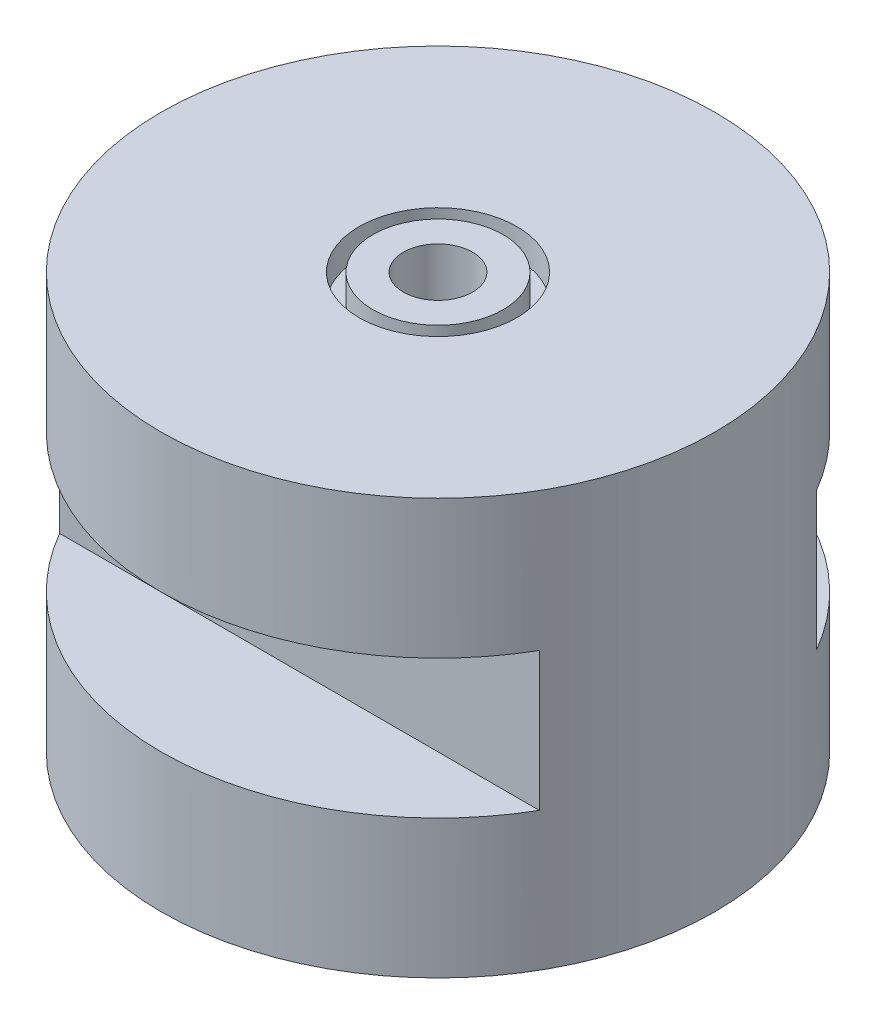
ISO-10303-21;
HEADER;
FILE_DESCRIPTION(('STEP AP214'),'2;1');
FILE_NAME('part.step','',(''),(''),'','','');
FILE_SCHEMA(('AUTOMOTIVE_DESIGN { 1 0 10303 214 1 1 1 1 }'));
ENDSEC;
DATA;
#1=APPLICATION_CONTEXT('core data for automotive mechanical design processes');
#2=APPLICATION_PROTOCOL_DEFINITION('international standard','automotive_design',2000,#1);
#3=PRODUCT_CONTEXT('',#1,'mechanical');
#4=PRODUCT('Part','Part','',(#3));
#5=PRODUCT_RELATED_PRODUCT_CATEGORY('part','',(#4));
#6=PRODUCT_DEFINITION_FORMATION('','',#4);
#7=PRODUCT_DEFINITION_CONTEXT('part definition',#1,'design');
#8=PRODUCT_DEFINITION('design','',#6,#7);
#9=PRODUCT_DEFINITION_SHAPE('','',#8);
#10=(LENGTH_UNIT() NAMED_UNIT(*) SI_UNIT(.MILLI.,.METRE.));
#11=(NAMED_UNIT(*) PLANE_ANGLE_UNIT() SI_UNIT($,.RADIAN.));
#12=(NAMED_UNIT(*) SI_UNIT($,.STERADIAN.) SOLID_ANGLE_UNIT());
#13=UNCERTAINTY_MEASURE_WITH_UNIT(LENGTH_MEASURE(1.E-05),#10,'distance_accuracy_value','');
#14=(GEOMETRIC_REPRESENTATION_CONTEXT(3) GLOBAL_UNCERTAINTY_ASSIGNED_CONTEXT((#13)) GLOBAL_UNIT_ASSIGNED_CONTEXT((#10,
#11,#12)) REPRESENTATION_CONTEXT('',''));
#15=CARTESIAN_POINT('',(0.,0.,0.));
#16=DIRECTION('',(0.,0.,1.));
#17=DIRECTION('',(1.,0.,0.));
#18=AXIS2_PLACEMENT_3D('',#15,#16,#17);
#19=CARTESIAN_POINT('',(0.,15.,0.));
#20=DIRECTION('',(0.,-1.,0.));
#21=DIRECTION('',(0.,0.,-1.));
#22=AXIS2_PLACEMENT_3D('',#19,#20,#21);
#23=CYLINDRICAL_SURFACE('',#22,10.);
#24=DIRECTION('',(0.,-1.,0.));
#25=VECTOR('',#24,1.);
#26=CARTESIAN_POINT('',(8.66025403784439,15.,-5.));
#27=LINE('',#26,#25);
#28=CARTESIAN_POINT('',(8.66025403784439,5.,-5.));
#29=VERTEX_POINT('',#28);
#30=CARTESIAN_POINT('',(8.66025403784439,10.,-5.));
#31=VERTEX_POINT('',#30);
#32=EDGE_CURVE('E82',#29,#31,#27,.F.);
#33=ORIENTED_EDGE('',*,*,#32,.T.);
#34=CARTESIAN_POINT('',(0.,10.,0.));
#35=DIRECTION('',(0.,1.,0.));
#36=DIRECTION('',(0.,0.,1.));
#37=AXIS2_PLACEMENT_3D('',#34,#35,#36);
#38=CIRCLE('',#37,10.);
#39=CARTESIAN_POINT('',(-8.66025403784439,10.,-5.));
#40=VERTEX_POINT('',#39);
#41=EDGE_CURVE('E11',#31,#40,#38,.T.);
#42=ORIENTED_EDGE('',*,*,#41,.T.);
#43=DIRECTION('',(0.,-1.,0.));
#44=VECTOR('',#43,1.);
#45=CARTESIAN_POINT('',(-8.66025403784439,15.,-5.));
#46=LINE('',#45,#44);
#47=CARTESIAN_POINT('',(-8.66025403784439,5.,-5.));
#48=VERTEX_POINT('',#47);
#49=EDGE_CURVE('E41',#40,#48,#46,.T.);
#50=ORIENTED_EDGE('',*,*,#49,.T.);
#51=CARTESIAN_POINT('',(0.,5.,0.));
#52=DIRECTION('',(0.,-1.,0.));
#53=DIRECTION('',(0.,0.,-1.));
#54=AXIS2_PLACEMENT_3D('',#51,#52,#53);
#55=CIRCLE('',#54,10.);
#56=EDGE_CURVE('E74',#48,#29,#55,.T.);
#57=ORIENTED_EDGE('',*,*,#56,.T.);
#58=EDGE_LOOP('',(#33,#42,#50,#57));
#59=FACE_BOUND('',#58,.T.);
#60=CARTESIAN_POINT('',(0.,10.,0.));
#61=DIRECTION('',(0.,1.,0.));
#62=DIRECTION('',(0.,0.,1.));
#63=AXIS2_PLACEMENT_3D('',#60,#61,#62);
#64=CIRCLE('',#63,10.);
#65=CARTESIAN_POINT('',(-8.66025403784439,10.,5.));
#66=VERTEX_POINT('',#65);
#67=CARTESIAN_POINT('',(8.66025403784439,10.,5.));
#68=VERTEX_POINT('',#67);
#69=EDGE_CURVE('E55',#66,#68,#64,.T.);
#70=ORIENTED_EDGE('',*,*,#69,.T.);
#71=DIRECTION('',(0.,-1.,0.));
#72=VECTOR('',#71,1.);
#73=CARTESIAN_POINT('',(8.66025403784439,15.,5.));
#74=LINE('',#73,#72);
#75=CARTESIAN_POINT('',(8.66025403784439,5.,5.));
#76=VERTEX_POINT('',#75);
#77=EDGE_CURVE('E93',#68,#76,#74,.T.);
#78=ORIENTED_EDGE('',*,*,#77,.T.);
#79=CARTESIAN_POINT('',(0.,5.,0.));
#80=DIRECTION('',(0.,-1.,0.));
#81=DIRECTION('',(0.,0.,-1.));
#82=AXIS2_PLACEMENT_3D('',#79,#80,#81);
#83=CIRCLE('',#82,10.);
#84=CARTESIAN_POINT('',(-8.66025403784439,5.,5.));
#85=VERTEX_POINT('',#84);
#86=EDGE_CURVE('E97',#76,#85,#83,.T.);
#87=ORIENTED_EDGE('',*,*,#86,.T.);
#88=DIRECTION('',(0.,-1.,0.));
#89=VECTOR('',#88,1.);
#90=CARTESIAN_POINT('',(-8.66025403784439,15.,5.));
#91=LINE('',#90,#89);
#92=EDGE_CURVE('E95',#85,#66,#91,.F.);
#93=ORIENTED_EDGE('',*,*,#92,.T.);
#94=EDGE_LOOP('',(#70,#78,#87,#93));
#95=FACE_BOUND('',#94,.T.);
#96=CARTESIAN_POINT('',(0.,15.,0.));
#97=DIRECTION('',(0.,1.,0.));
#98=DIRECTION('',(0.,0.,1.));
#99=AXIS2_PLACEMENT_3D('',#96,#97,#98);
#100=CIRCLE('',#99,10.);
#101=CARTESIAN_POINT('',(0.,15.,10.));
#102=VERTEX_POINT('',#101);
#103=EDGE_CURVE('E100',#102,#102,#100,.T.);
#104=ORIENTED_EDGE('',*,*,#103,.F.);
#105=EDGE_LOOP('',(#104));
#106=FACE_BOUND('',#105,.T.);
#107=CARTESIAN_POINT('',(0.,0.,0.));
#108=DIRECTION('',(0.,1.,0.));
#109=DIRECTION('',(0.,0.,1.));
#110=AXIS2_PLACEMENT_3D('',#107,#108,#109);
#111=CIRCLE('',#110,10.);
#112=CARTESIAN_POINT('',(0.,0.,10.));
#113=VERTEX_POINT('',#112);
#114=EDGE_CURVE('E101',#113,#113,#111,.T.);
#115=ORIENTED_EDGE('',*,*,#114,.T.);
#116=EDGE_LOOP('',(#115));
#117=FACE_BOUND('',#116,.T.);
#118=ADVANCED_FACE('F34',(#59,#95,#106,#117),#23,.T.);
#119=CARTESIAN_POINT('',(0.,15.,0.));
#120=DIRECTION('',(0.,1.,0.));
#121=DIRECTION('',(0.,0.,1.));
#122=AXIS2_PLACEMENT_3D('',#119,#120,#121);
#123=PLANE('',#122);
#124=CARTESIAN_POINT('',(0.,15.,0.));
#125=DIRECTION('',(0.,1.,0.));
#126=DIRECTION('',(0.,0.,1.));
#127=AXIS2_PLACEMENT_3D('',#124,#125,#126);
#128=CIRCLE('',#127,2.85);
#129=CARTESIAN_POINT('',(0.,15.,2.85));
#130=VERTEX_POINT('',#129);
#131=EDGE_CURVE('E107',#130,#130,#128,.T.);
#132=ORIENTED_EDGE('',*,*,#131,.F.);
#133=EDGE_LOOP('',(#132));
#134=FACE_BOUND('',#133,.T.);
#135=ORIENTED_EDGE('',*,*,#103,.T.);
#136=EDGE_LOOP('',(#135));
#137=FACE_BOUND('',#136,.T.);
#138=ADVANCED_FACE('F140',(#134,#137),#123,.T.);
#139=CARTESIAN_POINT('',(0.,0.,0.));
#140=DIRECTION('',(0.,1.,0.));
#141=DIRECTION('',(0.,0.,1.));
#142=AXIS2_PLACEMENT_3D('',#139,#140,#141);
#143=PLANE('',#142);
#144=CARTESIAN_POINT('',(0.,0.,0.));
#145=DIRECTION('',(0.,1.,0.));
#146=DIRECTION('',(0.,0.,1.));
#147=AXIS2_PLACEMENT_3D('',#144,#145,#146);
#148=CIRCLE('',#147,1.25);
#149=CARTESIAN_POINT('',(0.,0.,1.25));
#150=VERTEX_POINT('',#149);
#151=EDGE_CURVE('E116',#150,#150,#148,.T.);
#152=ORIENTED_EDGE('',*,*,#151,.T.);
#153=EDGE_LOOP('',(#152));
#154=FACE_BOUND('',#153,.T.);
#155=ORIENTED_EDGE('',*,*,#114,.F.);
#156=EDGE_LOOP('',(#155));
#157=FACE_BOUND('',#156,.T.);
#158=ADVANCED_FACE('F144',(#154,#157),#143,.F.);
#159=CARTESIAN_POINT('',(0.,14.,0.));
#160=DIRECTION('',(0.,1.,0.));
#161=DIRECTION('',(0.,0.,1.));
#162=AXIS2_PLACEMENT_3D('',#159,#160,#161);
#163=CYLINDRICAL_SURFACE('',#162,2.85);
#164=CARTESIAN_POINT('',(0.,14.,0.));
#165=DIRECTION('',(0.,1.,0.));
#166=DIRECTION('',(0.,0.,1.));
#167=AXIS2_PLACEMENT_3D('',#164,#165,#166);
#168=CIRCLE('',#167,2.85);
#169=CARTESIAN_POINT('',(0.,14.,2.85));
#170=VERTEX_POINT('',#169);
#171=EDGE_CURVE('E104',#170,#170,#168,.T.);
#172=ORIENTED_EDGE('',*,*,#171,.F.);
#173=EDGE_LOOP('',(#172));
#174=FACE_BOUND('',#173,.T.);
#175=ORIENTED_EDGE('',*,*,#131,.T.);
#176=EDGE_LOOP('',(#175));
#177=FACE_BOUND('',#176,.T.);
#178=ADVANCED_FACE('F151',(#174,#177),#163,.F.);
#179=CARTESIAN_POINT('',(0.,14.,0.));
#180=DIRECTION('',(0.,1.,0.));
#181=DIRECTION('',(0.,0.,1.));
#182=AXIS2_PLACEMENT_3D('',#179,#180,#181);
#183=PLANE('',#182);
#184=CARTESIAN_POINT('',(0.,14.,0.));
#185=DIRECTION('',(0.,1.,0.));
#186=DIRECTION('',(0.,0.,1.));
#187=AXIS2_PLACEMENT_3D('',#184,#185,#186);
#188=CIRCLE('',#187,2.35);
#189=CARTESIAN_POINT('',(0.,14.,2.35));
#190=VERTEX_POINT('',#189);
#191=EDGE_CURVE('E110',#190,#190,#188,.T.);
#192=ORIENTED_EDGE('',*,*,#191,.F.);
#193=EDGE_LOOP('',(#192));
#194=FACE_BOUND('',#193,.T.);
#195=ORIENTED_EDGE('',*,*,#171,.T.);
#196=EDGE_LOOP('',(#195));
#197=FACE_BOUND('',#196,.T.);
#198=ADVANCED_FACE('F167',(#194,#197),#183,.T.);
#199=CARTESIAN_POINT('',(0.,14.,0.));
#200=DIRECTION('',(0.,1.,0.));
#201=DIRECTION('',(0.,0.,1.));
#202=AXIS2_PLACEMENT_3D('',#199,#200,#201);
#203=CYLINDRICAL_SURFACE('',#202,2.35);
#204=ORIENTED_EDGE('',*,*,#191,.T.);
#205=EDGE_LOOP('',(#204));
#206=FACE_BOUND('',#205,.T.);
#207=CARTESIAN_POINT('',(0.,15.,0.));
#208=DIRECTION('',(0.,1.,0.));
#209=DIRECTION('',(0.,0.,1.));
#210=AXIS2_PLACEMENT_3D('',#207,#208,#209);
#211=CIRCLE('',#210,2.35);
#212=CARTESIAN_POINT('',(0.,15.,2.35));
#213=VERTEX_POINT('',#212);
#214=EDGE_CURVE('E113',#213,#213,#211,.T.);
#215=ORIENTED_EDGE('',*,*,#214,.F.);
#216=EDGE_LOOP('',(#215));
#217=FACE_BOUND('',#216,.T.);
#218=ADVANCED_FACE('F158',(#206,#217),#203,.T.);
#219=CARTESIAN_POINT('',(0.,15.,0.));
#220=DIRECTION('',(0.,1.,0.));
#221=DIRECTION('',(0.,0.,1.));
#222=AXIS2_PLACEMENT_3D('',#219,#220,#221);
#223=CIRCLE('',#222,1.25);
#224=CARTESIAN_POINT('',(0.,15.,1.25));
#225=VERTEX_POINT('',#224);
#226=EDGE_CURVE('E119',#225,#225,#223,.T.);
#227=ORIENTED_EDGE('',*,*,#226,.F.);
#228=EDGE_LOOP('',(#227));
#229=FACE_BOUND('',#228,.T.);
#230=ORIENTED_EDGE('',*,*,#214,.T.);
#231=EDGE_LOOP('',(#230));
#232=FACE_BOUND('',#231,.T.);
#233=ADVANCED_FACE('F147',(#229,#232),#123,.T.);
#234=CARTESIAN_POINT('',(0.,0.,0.));
#235=DIRECTION('',(0.,1.,0.));
#236=DIRECTION('',(0.,0.,1.));
#237=AXIS2_PLACEMENT_3D('',#234,#235,#236);
#238=CYLINDRICAL_SURFACE('',#237,1.25);
#239=ORIENTED_EDGE('',*,*,#151,.F.);
#240=EDGE_LOOP('',(#239));
#241=FACE_BOUND('',#240,.T.);
#242=ORIENTED_EDGE('',*,*,#226,.T.);
#243=EDGE_LOOP('',(#242));
#244=FACE_BOUND('',#243,.T.);
#245=ADVANCED_FACE('F157',(#241,#244),#238,.F.);
#246=CARTESIAN_POINT('',(-10.,10.,10.));
#247=DIRECTION('',(0.,1.,0.));
#248=DIRECTION('',(0.,0.,1.));
#249=AXIS2_PLACEMENT_3D('',#246,#247,#248);
#250=PLANE('',#249);
#251=ORIENTED_EDGE('',*,*,#69,.F.);
#252=DIRECTION('',(1.,0.,0.));
#253=VECTOR('',#252,1.);
#254=CARTESIAN_POINT('',(-10.,10.,5.));
#255=LINE('',#254,#253);
#256=EDGE_CURVE('E122',#66,#68,#255,.T.);
#257=ORIENTED_EDGE('',*,*,#256,.T.);
#258=EDGE_LOOP('',(#251,#257));
#259=FACE_BOUND('',#258,.T.);
#260=ADVANCED_FACE('F164',(#259),#250,.F.);
#261=CARTESIAN_POINT('',(-10.,5.,5.));
#262=DIRECTION('',(0.,0.,-1.));
#263=DIRECTION('',(-1.,0.,0.));
#264=AXIS2_PLACEMENT_3D('',#261,#262,#263);
#265=PLANE('',#264);
#266=ORIENTED_EDGE('',*,*,#256,.F.);
#267=ORIENTED_EDGE('',*,*,#92,.F.);
#268=DIRECTION('',(1.,0.,0.));
#269=VECTOR('',#268,1.);
#270=CARTESIAN_POINT('',(-10.,5.,5.));
#271=LINE('',#270,#269);
#272=EDGE_CURVE('E47',#85,#76,#271,.T.);
#273=ORIENTED_EDGE('',*,*,#272,.T.);
#274=ORIENTED_EDGE('',*,*,#77,.F.);
#275=EDGE_LOOP('',(#266,#267,#273,#274));
#276=FACE_BOUND('',#275,.T.);
#277=ADVANCED_FACE('F229',(#276),#265,.F.);
#278=CARTESIAN_POINT('',(-10.,5.,10.));
#279=DIRECTION('',(0.,-1.,0.));
#280=DIRECTION('',(0.,0.,-1.));
#281=AXIS2_PLACEMENT_3D('',#278,#279,#280);
#282=PLANE('',#281);
#283=ORIENTED_EDGE('',*,*,#272,.F.);
#284=ORIENTED_EDGE('',*,*,#86,.F.);
#285=EDGE_LOOP('',(#283,#284));
#286=FACE_BOUND('',#285,.T.);
#287=ADVANCED_FACE('F137',(#286),#282,.F.);
#288=CARTESIAN_POINT('',(-10.,10.,-5.));
#289=DIRECTION('',(0.,0.,1.));
#290=DIRECTION('',(1.,0.,0.));
#291=AXIS2_PLACEMENT_3D('',#288,#289,#290);
#292=PLANE('',#291);
#293=DIRECTION('',(1.,0.,0.));
#294=VECTOR('',#293,1.);
#295=CARTESIAN_POINT('',(-10.,10.,-5.));
#296=LINE('',#295,#294);
#297=EDGE_CURVE('E88',#40,#31,#296,.T.);
#298=ORIENTED_EDGE('',*,*,#297,.T.);
#299=ORIENTED_EDGE('',*,*,#32,.F.);
#300=DIRECTION('',(1.,0.,0.));
#301=VECTOR('',#300,1.);
#302=CARTESIAN_POINT('',(-10.,5.,-5.));
#303=LINE('',#302,#301);
#304=EDGE_CURVE('E77',#48,#29,#303,.T.);
#305=ORIENTED_EDGE('',*,*,#304,.F.);
#306=ORIENTED_EDGE('',*,*,#49,.F.);
#307=EDGE_LOOP('',(#298,#299,#305,#306));
#308=FACE_BOUND('',#307,.T.);
#309=ADVANCED_FACE('F86',(#308),#292,.F.);
#310=CARTESIAN_POINT('',(-10.,10.,-5.));
#311=DIRECTION('',(0.,1.,0.));
#312=DIRECTION('',(0.,0.,1.));
#313=AXIS2_PLACEMENT_3D('',#310,#311,#312);
#314=PLANE('',#313);
#315=ORIENTED_EDGE('',*,*,#297,.F.);
#316=ORIENTED_EDGE('',*,*,#41,.F.);
#317=EDGE_LOOP('',(#315,#316));
#318=FACE_BOUND('',#317,.T.);
#319=ADVANCED_FACE('F129',(#318),#314,.F.);
#320=CARTESIAN_POINT('',(-10.,5.,-5.));
#321=DIRECTION('',(0.,-1.,0.));
#322=DIRECTION('',(0.,0.,-1.));
#323=AXIS2_PLACEMENT_3D('',#320,#321,#322);
#324=PLANE('',#323);
#325=ORIENTED_EDGE('',*,*,#56,.F.);
#326=ORIENTED_EDGE('',*,*,#304,.T.);
#327=EDGE_LOOP('',(#325,#326));
#328=FACE_BOUND('',#327,.T.);
#329=ADVANCED_FACE('F76',(#328),#324,.F.);
#330=CLOSED_SHELL('',(#118,#138,#158,#178,#198,#218,#233,#245,#260,#277,#287,#309,#319,#329));
#331=MANIFOLD_SOLID_BREP('B2',#330);
#332=ADVANCED_BREP_SHAPE_REPRESENTATION('',(#18,#331),#14);
#333=SHAPE_DEFINITION_REPRESENTATION(#9,#332);
ENDSEC;
END-ISO-10303-21;
